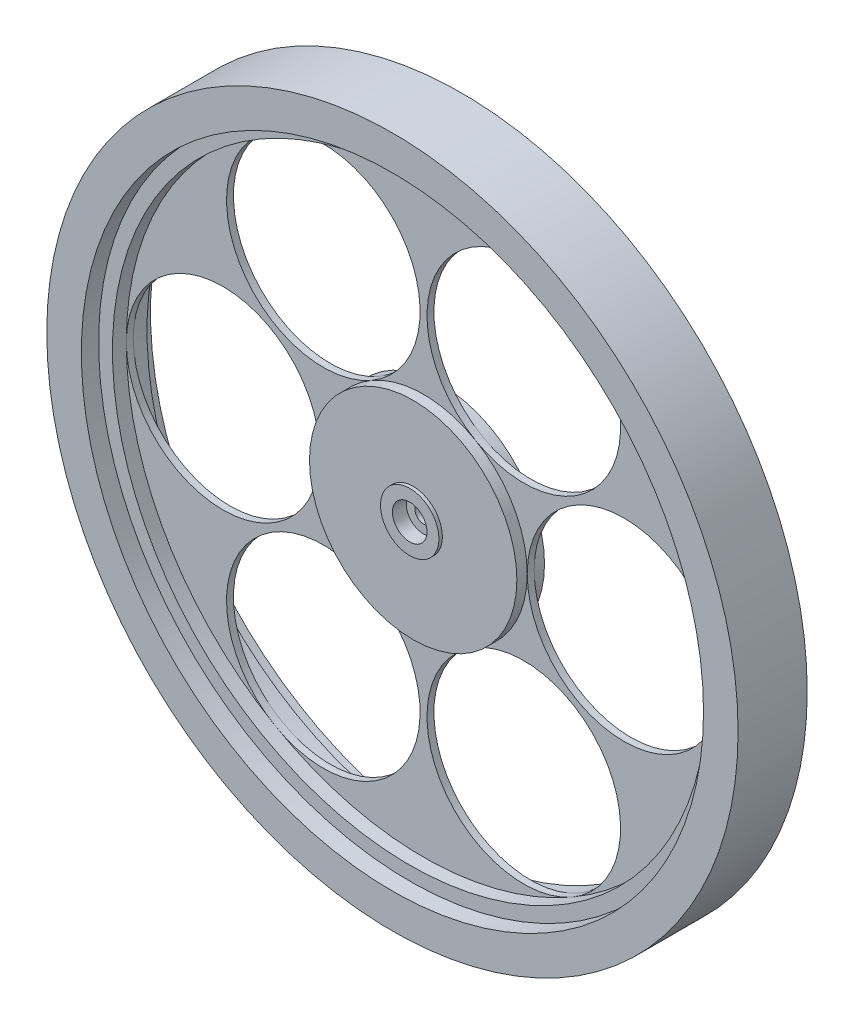
ISO-10303-21;
HEADER;
FILE_DESCRIPTION(('STEP AP214'),'2;1');
FILE_NAME('part.step','',(''),(''),'','','');
FILE_SCHEMA(('AUTOMOTIVE_DESIGN { 1 0 10303 214 1 1 1 1 }'));
ENDSEC;
DATA;
#1=APPLICATION_CONTEXT('core data for automotive mechanical design processes');
#2=APPLICATION_PROTOCOL_DEFINITION('international standard','automotive_design',2000,#1);
#3=PRODUCT_CONTEXT('',#1,'mechanical');
#4=PRODUCT('Part','Part','',(#3));
#5=PRODUCT_RELATED_PRODUCT_CATEGORY('part','',(#4));
#6=PRODUCT_DEFINITION_FORMATION('','',#4);
#7=PRODUCT_DEFINITION_CONTEXT('part definition',#1,'design');
#8=PRODUCT_DEFINITION('design','',#6,#7);
#9=PRODUCT_DEFINITION_SHAPE('','',#8);
#10=(LENGTH_UNIT() NAMED_UNIT(*) SI_UNIT(.MILLI.,.METRE.));
#11=(NAMED_UNIT(*) PLANE_ANGLE_UNIT() SI_UNIT($,.RADIAN.));
#12=(NAMED_UNIT(*) SI_UNIT($,.STERADIAN.) SOLID_ANGLE_UNIT());
#13=UNCERTAINTY_MEASURE_WITH_UNIT(LENGTH_MEASURE(1.E-05),#10,'distance_accuracy_value','');
#14=(GEOMETRIC_REPRESENTATION_CONTEXT(3) GLOBAL_UNCERTAINTY_ASSIGNED_CONTEXT((#13)) GLOBAL_UNIT_ASSIGNED_CONTEXT((#10,
#11,#12)) REPRESENTATION_CONTEXT('',''));
#15=CARTESIAN_POINT('',(0.,0.,0.));
#16=DIRECTION('',(0.,0.,1.));
#17=DIRECTION('',(1.,0.,0.));
#18=AXIS2_PLACEMENT_3D('',#15,#16,#17);
#19=CARTESIAN_POINT('',(0.,0.,2.54));
#20=DIRECTION('',(0.,0.,-1.));
#21=DIRECTION('',(-1.,0.,0.));
#22=AXIS2_PLACEMENT_3D('',#19,#20,#21);
#23=CYLINDRICAL_SURFACE('',#22,19.0500000000001);
#24=CARTESIAN_POINT('',(0.,0.,-2.54));
#25=DIRECTION('',(0.,0.,1.));
#26=DIRECTION('',(1.,0.,0.));
#27=AXIS2_PLACEMENT_3D('',#24,#25,#26);
#28=CIRCLE('',#27,19.0500000000001);
#29=CARTESIAN_POINT('',(19.0500000000001,0.,-2.54));
#30=VERTEX_POINT('',#29);
#31=EDGE_CURVE('E284',#30,#30,#28,.T.);
#32=ORIENTED_EDGE('',*,*,#31,.T.);
#33=EDGE_LOOP('',(#32));
#34=FACE_BOUND('',#33,.T.);
#35=CARTESIAN_POINT('',(0.,0.,-0.635));
#36=DIRECTION('',(0.,0.,1.));
#37=DIRECTION('',(1.,0.,0.));
#38=AXIS2_PLACEMENT_3D('',#35,#36,#37);
#39=CIRCLE('',#38,19.0500000000001);
#40=CARTESIAN_POINT('',(9.52500000000008,16.4977839420936,-0.635));
#41=VERTEX_POINT('',#40);
#42=CARTESIAN_POINT('',(-9.52500000000011,16.4977839420936,-0.635));
#43=VERTEX_POINT('',#42);
#44=EDGE_CURVE('E370',#41,#43,#39,.T.);
#45=ORIENTED_EDGE('',*,*,#44,.F.);
#46=CARTESIAN_POINT('',(0.,0.,-0.635));
#47=DIRECTION('',(0.,0.,1.));
#48=DIRECTION('',(1.,0.,0.));
#49=AXIS2_PLACEMENT_3D('',#46,#47,#48);
#50=CIRCLE('',#49,19.0500000000001);
#51=CARTESIAN_POINT('',(19.0500000000001,0.,-0.635));
#52=VERTEX_POINT('',#51);
#53=EDGE_CURVE('E265',#52,#41,#50,.T.);
#54=ORIENTED_EDGE('',*,*,#53,.F.);
#55=CARTESIAN_POINT('',(0.,0.,-0.635));
#56=DIRECTION('',(0.,0.,1.));
#57=DIRECTION('',(1.,0.,0.));
#58=AXIS2_PLACEMENT_3D('',#55,#56,#57);
#59=CIRCLE('',#58,19.0500000000001);
#60=CARTESIAN_POINT('',(9.52500000000009,-16.4977839420936,-0.635));
#61=VERTEX_POINT('',#60);
#62=EDGE_CURVE('E162',#61,#52,#59,.T.);
#63=ORIENTED_EDGE('',*,*,#62,.F.);
#64=CARTESIAN_POINT('',(0.,0.,-0.635));
#65=DIRECTION('',(0.,0.,1.));
#66=DIRECTION('',(1.,0.,0.));
#67=AXIS2_PLACEMENT_3D('',#64,#65,#66);
#68=CIRCLE('',#67,19.0500000000001);
#69=CARTESIAN_POINT('',(-9.52499999999999,-16.4977839420936,-0.635));
#70=VERTEX_POINT('',#69);
#71=EDGE_CURVE('E286',#70,#61,#68,.T.);
#72=ORIENTED_EDGE('',*,*,#71,.F.);
#73=CARTESIAN_POINT('',(0.,0.,-0.635));
#74=DIRECTION('',(0.,0.,1.));
#75=DIRECTION('',(1.,0.,0.));
#76=AXIS2_PLACEMENT_3D('',#73,#74,#75);
#77=CIRCLE('',#76,19.0500000000001);
#78=CARTESIAN_POINT('',(-19.0500000000001,0.,-0.635));
#79=VERTEX_POINT('',#78);
#80=EDGE_CURVE('E340',#79,#70,#77,.T.);
#81=ORIENTED_EDGE('',*,*,#80,.F.);
#82=CARTESIAN_POINT('',(0.,0.,-0.635));
#83=DIRECTION('',(0.,0.,1.));
#84=DIRECTION('',(1.,0.,0.));
#85=AXIS2_PLACEMENT_3D('',#82,#83,#84);
#86=CIRCLE('',#85,19.0500000000001);
#87=EDGE_CURVE('E312',#43,#79,#86,.T.);
#88=ORIENTED_EDGE('',*,*,#87,.F.);
#89=EDGE_LOOP('',(#45,#54,#63,#72,#81,#88));
#90=FACE_BOUND('',#89,.T.);
#91=ADVANCED_FACE('F137',(#34,#90),#23,.T.);
#92=CARTESIAN_POINT('',(-36.83,0.,0.635));
#93=DIRECTION('',(0.,0.,-1.));
#94=DIRECTION('',(-1.,0.,0.));
#95=AXIS2_PLACEMENT_3D('',#92,#93,#94);
#96=CYLINDRICAL_SURFACE('',#95,17.78);
#97=CARTESIAN_POINT('',(-36.83,0.,-0.635));
#98=DIRECTION('',(0.,0.,1.));
#99=DIRECTION('',(1.,0.,0.));
#100=AXIS2_PLACEMENT_3D('',#97,#98,#99);
#101=CIRCLE('',#100,17.78);
#102=CARTESIAN_POINT('',(-54.61,0.,-0.635));
#103=VERTEX_POINT('',#102);
#104=EDGE_CURVE('E332',#103,#79,#101,.T.);
#105=ORIENTED_EDGE('',*,*,#104,.F.);
#106=CARTESIAN_POINT('',(-36.83,0.,-0.635));
#107=DIRECTION('',(0.,0.,1.));
#108=DIRECTION('',(1.,0.,0.));
#109=AXIS2_PLACEMENT_3D('',#106,#107,#108);
#110=CIRCLE('',#109,17.78);
#111=EDGE_CURVE('E300',#79,#103,#110,.T.);
#112=ORIENTED_EDGE('',*,*,#111,.F.);
#113=EDGE_LOOP('',(#105,#112));
#114=FACE_BOUND('',#113,.T.);
#115=CARTESIAN_POINT('',(-36.83,0.,0.635));
#116=DIRECTION('',(0.,0.,1.));
#117=DIRECTION('',(1.,0.,0.));
#118=AXIS2_PLACEMENT_3D('',#115,#116,#117);
#119=CIRCLE('',#118,17.78);
#120=CARTESIAN_POINT('',(-19.0500000000001,0.,0.635));
#121=VERTEX_POINT('',#120);
#122=CARTESIAN_POINT('',(-54.61,0.,0.635));
#123=VERTEX_POINT('',#122);
#124=EDGE_CURVE('E303',#121,#123,#119,.T.);
#125=ORIENTED_EDGE('',*,*,#124,.T.);
#126=CARTESIAN_POINT('',(-36.83,0.,0.635));
#127=DIRECTION('',(0.,0.,1.));
#128=DIRECTION('',(1.,0.,0.));
#129=AXIS2_PLACEMENT_3D('',#126,#127,#128);
#130=CIRCLE('',#129,17.78);
#131=EDGE_CURVE('E421',#123,#121,#130,.T.);
#132=ORIENTED_EDGE('',*,*,#131,.T.);
#133=EDGE_LOOP('',(#125,#132));
#134=FACE_BOUND('',#133,.T.);
#135=ADVANCED_FACE('F139',(#114,#134),#96,.F.);
#136=CARTESIAN_POINT('',(-18.4150000000002,31.8957156213808,0.635));
#137=DIRECTION('',(0.,0.,-1.));
#138=DIRECTION('',(-1.,0.,0.));
#139=AXIS2_PLACEMENT_3D('',#136,#137,#138);
#140=CYLINDRICAL_SURFACE('',#139,17.78);
#141=CARTESIAN_POINT('',(-18.4150000000002,31.8957156213808,-0.635));
#142=DIRECTION('',(0.,0.,1.));
#143=DIRECTION('',(1.,0.,0.));
#144=AXIS2_PLACEMENT_3D('',#141,#142,#143);
#145=CIRCLE('',#144,17.78);
#146=CARTESIAN_POINT('',(-27.3050000000002,47.2936473006681,-0.635));
#147=VERTEX_POINT('',#146);
#148=EDGE_CURVE('E314',#147,#43,#145,.T.);
#149=ORIENTED_EDGE('',*,*,#148,.F.);
#150=CARTESIAN_POINT('',(-18.4150000000002,31.8957156213808,-0.635));
#151=DIRECTION('',(0.,0.,1.));
#152=DIRECTION('',(1.,0.,0.));
#153=AXIS2_PLACEMENT_3D('',#150,#151,#152);
#154=CIRCLE('',#153,17.78);
#155=EDGE_CURVE('E348',#43,#147,#154,.T.);
#156=ORIENTED_EDGE('',*,*,#155,.F.);
#157=EDGE_LOOP('',(#149,#156));
#158=FACE_BOUND('',#157,.T.);
#159=CARTESIAN_POINT('',(-18.4150000000002,31.8957156213808,0.635));
#160=DIRECTION('',(0.,0.,1.));
#161=DIRECTION('',(1.,0.,0.));
#162=AXIS2_PLACEMENT_3D('',#159,#160,#161);
#163=CIRCLE('',#162,17.78);
#164=CARTESIAN_POINT('',(-9.52500000000011,16.4977839420936,0.635));
#165=VERTEX_POINT('',#164);
#166=CARTESIAN_POINT('',(-27.3050000000002,47.2936473006681,0.635));
#167=VERTEX_POINT('',#166);
#168=EDGE_CURVE('E356',#165,#167,#163,.T.);
#169=ORIENTED_EDGE('',*,*,#168,.T.);
#170=CARTESIAN_POINT('',(-18.4150000000002,31.8957156213808,0.635));
#171=DIRECTION('',(0.,0.,1.));
#172=DIRECTION('',(1.,0.,0.));
#173=AXIS2_PLACEMENT_3D('',#170,#171,#172);
#174=CIRCLE('',#173,17.78);
#175=EDGE_CURVE('E146',#167,#165,#174,.T.);
#176=ORIENTED_EDGE('',*,*,#175,.T.);
#177=EDGE_LOOP('',(#169,#176));
#178=FACE_BOUND('',#177,.T.);
#179=ADVANCED_FACE('F484',(#158,#178),#140,.F.);
#180=CARTESIAN_POINT('',(0.,0.,0.635));
#181=DIRECTION('',(0.,0.,1.));
#182=DIRECTION('',(1.,0.,0.));
#183=AXIS2_PLACEMENT_3D('',#180,#181,#182);
#184=PLANE('',#183);
#185=ORIENTED_EDGE('',*,*,#124,.F.);
#186=CARTESIAN_POINT('',(0.,0.,0.635));
#187=DIRECTION('',(0.,0.,1.));
#188=DIRECTION('',(1.,0.,0.));
#189=AXIS2_PLACEMENT_3D('',#186,#187,#188);
#190=CIRCLE('',#189,19.0500000000001);
#191=EDGE_CURVE('E306',#165,#121,#190,.T.);
#192=ORIENTED_EDGE('',*,*,#191,.F.);
#193=ORIENTED_EDGE('',*,*,#175,.F.);
#194=CARTESIAN_POINT('',(0.,0.,0.635));
#195=DIRECTION('',(0.,0.,1.));
#196=DIRECTION('',(1.,0.,0.));
#197=AXIS2_PLACEMENT_3D('',#194,#195,#196);
#198=CIRCLE('',#197,54.61);
#199=EDGE_CURVE('E12',#167,#123,#198,.T.);
#200=ORIENTED_EDGE('',*,*,#199,.T.);
#201=EDGE_LOOP('',(#185,#192,#193,#200));
#202=FACE_BOUND('',#201,.T.);
#203=ADVANCED_FACE('F417',(#202),#184,.T.);
#204=CARTESIAN_POINT('',(0.,0.,-0.635));
#205=DIRECTION('',(0.,0.,1.));
#206=DIRECTION('',(1.,0.,0.));
#207=AXIS2_PLACEMENT_3D('',#204,#205,#206);
#208=PLANE('',#207);
#209=ORIENTED_EDGE('',*,*,#111,.T.);
#210=CARTESIAN_POINT('',(0.,0.,-0.635));
#211=DIRECTION('',(0.,0.,1.));
#212=DIRECTION('',(1.,0.,0.));
#213=AXIS2_PLACEMENT_3D('',#210,#211,#212);
#214=CIRCLE('',#213,54.61);
#215=EDGE_CURVE('E141',#147,#103,#214,.T.);
#216=ORIENTED_EDGE('',*,*,#215,.F.);
#217=ORIENTED_EDGE('',*,*,#148,.T.);
#218=ORIENTED_EDGE('',*,*,#87,.T.);
#219=EDGE_LOOP('',(#209,#216,#217,#218));
#220=FACE_BOUND('',#219,.T.);
#221=ADVANCED_FACE('F490',(#220),#208,.F.);
#222=CARTESIAN_POINT('',(0.,0.,0.635));
#223=DIRECTION('',(0.,0.,1.));
#224=DIRECTION('',(1.,0.,0.));
#225=AXIS2_PLACEMENT_3D('',#222,#223,#224);
#226=CIRCLE('',#225,19.0500000000001);
#227=CARTESIAN_POINT('',(19.0500000000001,0.,0.635));
#228=VERTEX_POINT('',#227);
#229=CARTESIAN_POINT('',(9.52500000000013,16.4977839420937,0.635));
#230=VERTEX_POINT('',#229);
#231=EDGE_CURVE('E154',#228,#230,#226,.T.);
#232=ORIENTED_EDGE('',*,*,#231,.T.);
#233=CARTESIAN_POINT('',(0.,0.,0.635));
#234=DIRECTION('',(0.,0.,1.));
#235=DIRECTION('',(1.,0.,0.));
#236=AXIS2_PLACEMENT_3D('',#233,#234,#235);
#237=CIRCLE('',#236,19.0500000000001);
#238=EDGE_CURVE('E359',#230,#165,#237,.T.);
#239=ORIENTED_EDGE('',*,*,#238,.T.);
#240=ORIENTED_EDGE('',*,*,#191,.T.);
#241=CARTESIAN_POINT('',(0.,0.,0.635));
#242=DIRECTION('',(0.,0.,1.));
#243=DIRECTION('',(1.,0.,0.));
#244=AXIS2_PLACEMENT_3D('',#241,#242,#243);
#245=CIRCLE('',#244,19.0500000000001);
#246=CARTESIAN_POINT('',(-9.52499999999999,-16.4977839420936,0.635));
#247=VERTEX_POINT('',#246);
#248=EDGE_CURVE('E425',#121,#247,#245,.T.);
#249=ORIENTED_EDGE('',*,*,#248,.T.);
#250=CARTESIAN_POINT('',(0.,0.,0.635));
#251=DIRECTION('',(0.,0.,1.));
#252=DIRECTION('',(1.,0.,0.));
#253=AXIS2_PLACEMENT_3D('',#250,#251,#252);
#254=CIRCLE('',#253,19.0500000000001);
#255=CARTESIAN_POINT('',(9.52500000000009,-16.4977839420936,0.635));
#256=VERTEX_POINT('',#255);
#257=EDGE_CURVE('E244',#247,#256,#254,.T.);
#258=ORIENTED_EDGE('',*,*,#257,.T.);
#259=CARTESIAN_POINT('',(0.,0.,0.635));
#260=DIRECTION('',(0.,0.,1.));
#261=DIRECTION('',(1.,0.,0.));
#262=AXIS2_PLACEMENT_3D('',#259,#260,#261);
#263=CIRCLE('',#262,19.0500000000001);
#264=EDGE_CURVE('E233',#256,#228,#263,.T.);
#265=ORIENTED_EDGE('',*,*,#264,.T.);
#266=EDGE_LOOP('',(#232,#239,#240,#249,#258,#265));
#267=FACE_BOUND('',#266,.T.);
#268=CARTESIAN_POINT('',(0.,0.,2.54));
#269=DIRECTION('',(0.,0.,1.));
#270=DIRECTION('',(1.,0.,0.));
#271=AXIS2_PLACEMENT_3D('',#268,#269,#270);
#272=CIRCLE('',#271,19.0500000000001);
#273=CARTESIAN_POINT('',(19.0500000000001,0.,2.54));
#274=VERTEX_POINT('',#273);
#275=EDGE_CURVE('E297',#274,#274,#272,.T.);
#276=ORIENTED_EDGE('',*,*,#275,.F.);
#277=EDGE_LOOP('',(#276));
#278=FACE_BOUND('',#277,.T.);
#279=ADVANCED_FACE('F240',(#267,#278),#23,.T.);
#280=CARTESIAN_POINT('',(0.,0.,2.54));
#281=DIRECTION('',(0.,0.,1.));
#282=DIRECTION('',(1.,0.,0.));
#283=AXIS2_PLACEMENT_3D('',#280,#281,#282);
#284=PLANE('',#283);
#285=CARTESIAN_POINT('',(0.,0.,2.54));
#286=DIRECTION('',(0.,0.,1.));
#287=DIRECTION('',(1.,0.,0.));
#288=AXIS2_PLACEMENT_3D('',#285,#286,#287);
#289=CIRCLE('',#288,5.36395316401893);
#290=CARTESIAN_POINT('',(5.36395316401893,0.,2.54));
#291=VERTEX_POINT('',#290);
#292=EDGE_CURVE('E294',#291,#291,#289,.T.);
#293=ORIENTED_EDGE('',*,*,#292,.F.);
#294=EDGE_LOOP('',(#293));
#295=FACE_BOUND('',#294,.T.);
#296=ORIENTED_EDGE('',*,*,#275,.T.);
#297=EDGE_LOOP('',(#296));
#298=FACE_BOUND('',#297,.T.);
#299=ADVANCED_FACE('F489',(#295,#298),#284,.T.);
#300=CARTESIAN_POINT('',(0.,0.,-2.54));
#301=DIRECTION('',(0.,0.,1.));
#302=DIRECTION('',(1.,0.,0.));
#303=AXIS2_PLACEMENT_3D('',#300,#301,#302);
#304=PLANE('',#303);
#305=CARTESIAN_POINT('',(0.,0.,-2.54));
#306=DIRECTION('',(0.,0.,1.));
#307=DIRECTION('',(1.,0.,0.));
#308=AXIS2_PLACEMENT_3D('',#305,#306,#307);
#309=CIRCLE('',#308,5.36395316401893);
#310=CARTESIAN_POINT('',(5.36395316401893,0.,-2.54));
#311=VERTEX_POINT('',#310);
#312=EDGE_CURVE('E266',#311,#311,#309,.F.);
#313=ORIENTED_EDGE('',*,*,#312,.F.);
#314=EDGE_LOOP('',(#313));
#315=FACE_BOUND('',#314,.T.);
#316=ORIENTED_EDGE('',*,*,#31,.F.);
#317=EDGE_LOOP('',(#316));
#318=FACE_BOUND('',#317,.T.);
#319=ADVANCED_FACE('F495',(#315,#318),#304,.F.);
#320=CARTESIAN_POINT('',(18.4150000000001,-31.8957156213808,0.635));
#321=DIRECTION('',(0.,0.,-1.));
#322=DIRECTION('',(-1.,0.,0.));
#323=AXIS2_PLACEMENT_3D('',#320,#321,#322);
#324=CYLINDRICAL_SURFACE('',#323,17.78);
#325=CARTESIAN_POINT('',(18.4150000000001,-31.8957156213808,-0.635));
#326=DIRECTION('',(0.,0.,1.));
#327=DIRECTION('',(1.,0.,0.));
#328=AXIS2_PLACEMENT_3D('',#325,#326,#327);
#329=CIRCLE('',#328,17.78);
#330=CARTESIAN_POINT('',(27.3050000000002,-47.2936473006681,-0.635));
#331=VERTEX_POINT('',#330);
#332=EDGE_CURVE('E259',#61,#331,#329,.T.);
#333=ORIENTED_EDGE('',*,*,#332,.F.);
#334=CARTESIAN_POINT('',(18.4150000000001,-31.8957156213808,-0.635));
#335=DIRECTION('',(0.,0.,1.));
#336=DIRECTION('',(1.,0.,0.));
#337=AXIS2_PLACEMENT_3D('',#334,#335,#336);
#338=CIRCLE('',#337,17.78);
#339=EDGE_CURVE('E438',#331,#61,#338,.T.);
#340=ORIENTED_EDGE('',*,*,#339,.F.);
#341=EDGE_LOOP('',(#333,#340));
#342=FACE_BOUND('',#341,.T.);
#343=CARTESIAN_POINT('',(18.4150000000001,-31.8957156213808,0.635));
#344=DIRECTION('',(0.,0.,1.));
#345=DIRECTION('',(1.,0.,0.));
#346=AXIS2_PLACEMENT_3D('',#343,#344,#345);
#347=CIRCLE('',#346,17.78);
#348=CARTESIAN_POINT('',(27.3050000000002,-47.2936473006681,0.635));
#349=VERTEX_POINT('',#348);
#350=EDGE_CURVE('E432',#349,#256,#347,.T.);
#351=ORIENTED_EDGE('',*,*,#350,.T.);
#352=CARTESIAN_POINT('',(18.4150000000001,-31.8957156213808,0.635));
#353=DIRECTION('',(0.,0.,1.));
#354=DIRECTION('',(1.,0.,0.));
#355=AXIS2_PLACEMENT_3D('',#352,#353,#354);
#356=CIRCLE('',#355,17.78);
#357=EDGE_CURVE('E274',#256,#349,#356,.T.);
#358=ORIENTED_EDGE('',*,*,#357,.T.);
#359=EDGE_LOOP('',(#351,#358));
#360=FACE_BOUND('',#359,.T.);
#361=ADVANCED_FACE('F524',(#342,#360),#324,.F.);
#362=CARTESIAN_POINT('',(-18.4149999999999,-31.8957156213809,0.635));
#363=DIRECTION('',(0.,0.,-1.));
#364=DIRECTION('',(-1.,0.,0.));
#365=AXIS2_PLACEMENT_3D('',#362,#363,#364);
#366=CYLINDRICAL_SURFACE('',#365,17.78);
#367=CARTESIAN_POINT('',(-18.4149999999999,-31.8957156213809,-0.635));
#368=DIRECTION('',(0.,0.,1.));
#369=DIRECTION('',(1.,0.,0.));
#370=AXIS2_PLACEMENT_3D('',#367,#368,#369);
#371=CIRCLE('',#370,17.78);
#372=CARTESIAN_POINT('',(-27.3049999999999,-47.2936473006683,-0.635));
#373=VERTEX_POINT('',#372);
#374=EDGE_CURVE('E246',#70,#373,#371,.T.);
#375=ORIENTED_EDGE('',*,*,#374,.F.);
#376=CARTESIAN_POINT('',(-18.4149999999999,-31.8957156213809,-0.635));
#377=DIRECTION('',(0.,0.,1.));
#378=DIRECTION('',(1.,0.,0.));
#379=AXIS2_PLACEMENT_3D('',#376,#377,#378);
#380=CIRCLE('',#379,17.78);
#381=EDGE_CURVE('E289',#373,#70,#380,.T.);
#382=ORIENTED_EDGE('',*,*,#381,.F.);
#383=EDGE_LOOP('',(#375,#382));
#384=FACE_BOUND('',#383,.T.);
#385=CARTESIAN_POINT('',(-18.4149999999999,-31.8957156213809,0.635));
#386=DIRECTION('',(0.,0.,1.));
#387=DIRECTION('',(1.,0.,0.));
#388=AXIS2_PLACEMENT_3D('',#385,#386,#387);
#389=CIRCLE('',#388,17.78);
#390=CARTESIAN_POINT('',(-27.3049999999999,-47.2936473006683,0.635));
#391=VERTEX_POINT('',#390);
#392=EDGE_CURVE('E279',#391,#247,#389,.T.);
#393=ORIENTED_EDGE('',*,*,#392,.T.);
#394=CARTESIAN_POINT('',(-18.4149999999999,-31.8957156213809,0.635));
#395=DIRECTION('',(0.,0.,1.));
#396=DIRECTION('',(1.,0.,0.));
#397=AXIS2_PLACEMENT_3D('',#394,#395,#396);
#398=CIRCLE('',#397,17.78);
#399=EDGE_CURVE('E335',#247,#391,#398,.T.);
#400=ORIENTED_EDGE('',*,*,#399,.T.);
#401=EDGE_LOOP('',(#393,#400));
#402=FACE_BOUND('',#401,.T.);
#403=ADVANCED_FACE('F515',(#384,#402),#366,.F.);
#404=CARTESIAN_POINT('',(0.,0.,0.635));
#405=DIRECTION('',(0.,0.,1.));
#406=DIRECTION('',(1.,0.,0.));
#407=AXIS2_PLACEMENT_3D('',#404,#405,#406);
#408=PLANE('',#407);
#409=ORIENTED_EDGE('',*,*,#357,.F.);
#410=ORIENTED_EDGE('',*,*,#257,.F.);
#411=ORIENTED_EDGE('',*,*,#392,.F.);
#412=CARTESIAN_POINT('',(0.,0.,0.635));
#413=DIRECTION('',(0.,0.,1.));
#414=DIRECTION('',(1.,0.,0.));
#415=AXIS2_PLACEMENT_3D('',#412,#413,#414);
#416=CIRCLE('',#415,54.61);
#417=EDGE_CURVE('E282',#391,#349,#416,.T.);
#418=ORIENTED_EDGE('',*,*,#417,.T.);
#419=EDGE_LOOP('',(#409,#410,#411,#418));
#420=FACE_BOUND('',#419,.T.);
#421=ADVANCED_FACE('F529',(#420),#408,.T.);
#422=CARTESIAN_POINT('',(0.,0.,-0.635));
#423=DIRECTION('',(0.,0.,1.));
#424=DIRECTION('',(1.,0.,0.));
#425=AXIS2_PLACEMENT_3D('',#422,#423,#424);
#426=PLANE('',#425);
#427=ORIENTED_EDGE('',*,*,#332,.T.);
#428=CARTESIAN_POINT('',(0.,0.,-0.635));
#429=DIRECTION('',(0.,0.,1.));
#430=DIRECTION('',(1.,0.,0.));
#431=AXIS2_PLACEMENT_3D('',#428,#429,#430);
#432=CIRCLE('',#431,54.61);
#433=EDGE_CURVE('E277',#373,#331,#432,.T.);
#434=ORIENTED_EDGE('',*,*,#433,.F.);
#435=ORIENTED_EDGE('',*,*,#381,.T.);
#436=ORIENTED_EDGE('',*,*,#71,.T.);
#437=EDGE_LOOP('',(#427,#434,#435,#436));
#438=FACE_BOUND('',#437,.T.);
#439=ADVANCED_FACE('F518',(#438),#426,.F.);
#440=CARTESIAN_POINT('',(18.4150000000001,31.8957156213809,0.635));
#441=DIRECTION('',(0.,0.,-1.));
#442=DIRECTION('',(-1.,0.,0.));
#443=AXIS2_PLACEMENT_3D('',#440,#441,#442);
#444=CYLINDRICAL_SURFACE('',#443,17.7799999999998);
#445=CARTESIAN_POINT('',(18.4150000000001,31.8957156213809,-0.635));
#446=DIRECTION('',(0.,0.,1.));
#447=DIRECTION('',(1.,0.,0.));
#448=AXIS2_PLACEMENT_3D('',#445,#446,#447);
#449=CIRCLE('',#448,17.7799999999998);
#450=CARTESIAN_POINT('',(27.3050000000001,47.2936473006681,-0.635));
#451=VERTEX_POINT('',#450);
#452=EDGE_CURVE('E263',#41,#451,#449,.T.);
#453=ORIENTED_EDGE('',*,*,#452,.F.);
#454=CARTESIAN_POINT('',(18.4150000000001,31.8957156213809,-0.635));
#455=DIRECTION('',(0.,0.,1.));
#456=DIRECTION('',(1.,0.,0.));
#457=AXIS2_PLACEMENT_3D('',#454,#455,#456);
#458=CIRCLE('',#457,17.7799999999998);
#459=EDGE_CURVE('E373',#451,#41,#458,.T.);
#460=ORIENTED_EDGE('',*,*,#459,.F.);
#461=EDGE_LOOP('',(#453,#460));
#462=FACE_BOUND('',#461,.T.);
#463=CARTESIAN_POINT('',(18.4150000000001,31.8957156213809,0.635));
#464=DIRECTION('',(0.,0.,1.));
#465=DIRECTION('',(1.,0.,0.));
#466=AXIS2_PLACEMENT_3D('',#463,#464,#465);
#467=CIRCLE('',#466,17.7799999999998);
#468=CARTESIAN_POINT('',(27.3050000000001,47.2936473006681,0.635));
#469=VERTEX_POINT('',#468);
#470=EDGE_CURVE('E361',#469,#230,#467,.T.);
#471=ORIENTED_EDGE('',*,*,#470,.T.);
#472=CARTESIAN_POINT('',(18.4150000000001,31.8957156213809,0.635));
#473=DIRECTION('',(0.,0.,1.));
#474=DIRECTION('',(1.,0.,0.));
#475=AXIS2_PLACEMENT_3D('',#472,#473,#474);
#476=CIRCLE('',#475,17.7799999999998);
#477=EDGE_CURVE('E253',#230,#469,#476,.T.);
#478=ORIENTED_EDGE('',*,*,#477,.T.);
#479=EDGE_LOOP('',(#471,#478));
#480=FACE_BOUND('',#479,.T.);
#481=ADVANCED_FACE('F403',(#462,#480),#444,.F.);
#482=CARTESIAN_POINT('',(36.83,0.,0.635));
#483=DIRECTION('',(0.,0.,-1.));
#484=DIRECTION('',(-1.,0.,0.));
#485=AXIS2_PLACEMENT_3D('',#482,#483,#484);
#486=CYLINDRICAL_SURFACE('',#485,17.78);
#487=CARTESIAN_POINT('',(36.83,0.,-0.635));
#488=DIRECTION('',(0.,0.,1.));
#489=DIRECTION('',(1.,0.,0.));
#490=AXIS2_PLACEMENT_3D('',#487,#488,#489);
#491=CIRCLE('',#490,17.78);
#492=CARTESIAN_POINT('',(54.61,0.,-0.635));
#493=VERTEX_POINT('',#492);
#494=EDGE_CURVE('E433',#52,#493,#491,.T.);
#495=ORIENTED_EDGE('',*,*,#494,.F.);
#496=CARTESIAN_POINT('',(36.83,0.,-0.635));
#497=DIRECTION('',(0.,0.,1.));
#498=DIRECTION('',(1.,0.,0.));
#499=AXIS2_PLACEMENT_3D('',#496,#497,#498);
#500=CIRCLE('',#499,17.78);
#501=EDGE_CURVE('E268',#493,#52,#500,.T.);
#502=ORIENTED_EDGE('',*,*,#501,.F.);
#503=EDGE_LOOP('',(#495,#502));
#504=FACE_BOUND('',#503,.T.);
#505=CARTESIAN_POINT('',(36.83,0.,0.635));
#506=DIRECTION('',(0.,0.,1.));
#507=DIRECTION('',(1.,0.,0.));
#508=AXIS2_PLACEMENT_3D('',#505,#506,#507);
#509=CIRCLE('',#508,17.78);
#510=CARTESIAN_POINT('',(54.61,0.,0.635));
#511=VERTEX_POINT('',#510);
#512=EDGE_CURVE('E250',#511,#228,#509,.T.);
#513=ORIENTED_EDGE('',*,*,#512,.T.);
#514=CARTESIAN_POINT('',(36.83,0.,0.635));
#515=DIRECTION('',(0.,0.,1.));
#516=DIRECTION('',(1.,0.,0.));
#517=AXIS2_PLACEMENT_3D('',#514,#515,#516);
#518=CIRCLE('',#517,17.78);
#519=EDGE_CURVE('E230',#228,#511,#518,.T.);
#520=ORIENTED_EDGE('',*,*,#519,.T.);
#521=EDGE_LOOP('',(#513,#520));
#522=FACE_BOUND('',#521,.T.);
#523=ADVANCED_FACE('F256',(#504,#522),#486,.F.);
#524=CARTESIAN_POINT('',(0.,0.,0.635));
#525=DIRECTION('',(0.,0.,1.));
#526=DIRECTION('',(1.,0.,0.));
#527=AXIS2_PLACEMENT_3D('',#524,#525,#526);
#528=PLANE('',#527);
#529=ORIENTED_EDGE('',*,*,#477,.F.);
#530=ORIENTED_EDGE('',*,*,#231,.F.);
#531=ORIENTED_EDGE('',*,*,#512,.F.);
#532=CARTESIAN_POINT('',(0.,0.,0.635));
#533=DIRECTION('',(0.,0.,1.));
#534=DIRECTION('',(1.,0.,0.));
#535=AXIS2_PLACEMENT_3D('',#532,#533,#534);
#536=CIRCLE('',#535,54.61);
#537=EDGE_CURVE('E257',#511,#469,#536,.T.);
#538=ORIENTED_EDGE('',*,*,#537,.T.);
#539=EDGE_LOOP('',(#529,#530,#531,#538));
#540=FACE_BOUND('',#539,.T.);
#541=ADVANCED_FACE('F249',(#540),#528,.T.);
#542=CARTESIAN_POINT('',(0.,0.,-0.635));
#543=DIRECTION('',(0.,0.,1.));
#544=DIRECTION('',(1.,0.,0.));
#545=AXIS2_PLACEMENT_3D('',#542,#543,#544);
#546=PLANE('',#545);
#547=ORIENTED_EDGE('',*,*,#452,.T.);
#548=CARTESIAN_POINT('',(0.,0.,-0.635));
#549=DIRECTION('',(0.,0.,1.));
#550=DIRECTION('',(1.,0.,0.));
#551=AXIS2_PLACEMENT_3D('',#548,#549,#550);
#552=CIRCLE('',#551,54.61);
#553=EDGE_CURVE('E271',#493,#451,#552,.T.);
#554=ORIENTED_EDGE('',*,*,#553,.F.);
#555=ORIENTED_EDGE('',*,*,#501,.T.);
#556=ORIENTED_EDGE('',*,*,#53,.T.);
#557=EDGE_LOOP('',(#547,#554,#555,#556));
#558=FACE_BOUND('',#557,.T.);
#559=ADVANCED_FACE('F548',(#558),#546,.F.);
#560=CARTESIAN_POINT('',(0.,0.,3.175));
#561=DIRECTION('',(0.,0.,-1.));
#562=DIRECTION('',(-1.,0.,0.));
#563=AXIS2_PLACEMENT_3D('',#560,#561,#562);
#564=CYLINDRICAL_SURFACE('',#563,5.36395316401893);
#565=CARTESIAN_POINT('',(0.,0.,-3.175));
#566=DIRECTION('',(0.,0.,1.));
#567=DIRECTION('',(1.,0.,0.));
#568=AXIS2_PLACEMENT_3D('',#565,#566,#567);
#569=CIRCLE('',#568,5.36395316401893);
#570=CARTESIAN_POINT('',(5.36395316401893,0.,-3.175));
#571=VERTEX_POINT('',#570);
#572=EDGE_CURVE('E381',#571,#571,#569,.T.);
#573=ORIENTED_EDGE('',*,*,#572,.T.);
#574=EDGE_LOOP('',(#573));
#575=FACE_BOUND('',#574,.T.);
#576=ORIENTED_EDGE('',*,*,#312,.T.);
#577=EDGE_LOOP('',(#576));
#578=FACE_BOUND('',#577,.T.);
#579=ADVANCED_FACE('F545',(#575,#578),#564,.T.);
#580=CARTESIAN_POINT('',(0.,0.,0.635));
#581=DIRECTION('',(0.,0.,-1.));
#582=DIRECTION('',(-1.,0.,0.));
#583=AXIS2_PLACEMENT_3D('',#580,#581,#582);
#584=CYLINDRICAL_SURFACE('',#583,1.5875);
#585=CARTESIAN_POINT('',(0.,0.,0.635));
#586=DIRECTION('',(0.,0.,1.));
#587=DIRECTION('',(1.,0.,0.));
#588=AXIS2_PLACEMENT_3D('',#585,#586,#587);
#589=CIRCLE('',#588,1.5875);
#590=CARTESIAN_POINT('',(1.5875,0.,0.635));
#591=VERTEX_POINT('',#590);
#592=EDGE_CURVE('E392',#591,#591,#589,.T.);
#593=ORIENTED_EDGE('',*,*,#592,.T.);
#594=EDGE_LOOP('',(#593));
#595=FACE_BOUND('',#594,.T.);
#596=CARTESIAN_POINT('',(0.,0.,-0.635));
#597=DIRECTION('',(0.,0.,1.));
#598=DIRECTION('',(1.,0.,0.));
#599=AXIS2_PLACEMENT_3D('',#596,#597,#598);
#600=CIRCLE('',#599,1.5875);
#601=CARTESIAN_POINT('',(1.5875,0.,-0.635));
#602=VERTEX_POINT('',#601);
#603=EDGE_CURVE('E391',#602,#602,#600,.T.);
#604=ORIENTED_EDGE('',*,*,#603,.F.);
#605=EDGE_LOOP('',(#604));
#606=FACE_BOUND('',#605,.T.);
#607=ADVANCED_FACE('F547',(#595,#606),#584,.F.);
#608=CARTESIAN_POINT('',(0.,0.,0.635));
#609=DIRECTION('',(0.,0.,1.));
#610=DIRECTION('',(1.,0.,0.));
#611=AXIS2_PLACEMENT_3D('',#608,#609,#610);
#612=PLANE('',#611);
#613=ORIENTED_EDGE('',*,*,#592,.F.);
#614=EDGE_LOOP('',(#613));
#615=FACE_BOUND('',#614,.T.);
#616=CARTESIAN_POINT('',(0.,0.,0.635));
#617=DIRECTION('',(0.,0.,1.));
#618=DIRECTION('',(1.,0.,0.));
#619=AXIS2_PLACEMENT_3D('',#616,#617,#618);
#620=CIRCLE('',#619,3.175);
#621=CARTESIAN_POINT('',(3.175,0.,0.635));
#622=VERTEX_POINT('',#621);
#623=EDGE_CURVE('E384',#622,#622,#620,.F.);
#624=ORIENTED_EDGE('',*,*,#623,.F.);
#625=EDGE_LOOP('',(#624));
#626=FACE_BOUND('',#625,.T.);
#627=ADVANCED_FACE('F556',(#615,#626),#612,.T.);
#628=CARTESIAN_POINT('',(0.,0.,-0.635));
#629=DIRECTION('',(0.,0.,1.));
#630=DIRECTION('',(1.,0.,0.));
#631=AXIS2_PLACEMENT_3D('',#628,#629,#630);
#632=PLANE('',#631);
#633=ORIENTED_EDGE('',*,*,#603,.T.);
#634=EDGE_LOOP('',(#633));
#635=FACE_BOUND('',#634,.T.);
#636=CARTESIAN_POINT('',(0.,0.,-0.635));
#637=DIRECTION('',(0.,0.,1.));
#638=DIRECTION('',(1.,0.,0.));
#639=AXIS2_PLACEMENT_3D('',#636,#637,#638);
#640=CIRCLE('',#639,3.175);
#641=CARTESIAN_POINT('',(3.175,0.,-0.635));
#642=VERTEX_POINT('',#641);
#643=EDGE_CURVE('E395',#642,#642,#640,.T.);
#644=ORIENTED_EDGE('',*,*,#643,.F.);
#645=EDGE_LOOP('',(#644));
#646=FACE_BOUND('',#645,.T.);
#647=ADVANCED_FACE('F585',(#635,#646),#632,.F.);
#648=CARTESIAN_POINT('',(0.,0.,3.175));
#649=DIRECTION('',(0.,0.,-1.));
#650=DIRECTION('',(-1.,0.,0.));
#651=AXIS2_PLACEMENT_3D('',#648,#649,#650);
#652=CYLINDRICAL_SURFACE('',#651,3.175);
#653=CARTESIAN_POINT('',(0.,0.,-3.175));
#654=DIRECTION('',(0.,0.,1.));
#655=DIRECTION('',(1.,0.,0.));
#656=AXIS2_PLACEMENT_3D('',#653,#654,#655);
#657=CIRCLE('',#656,3.175);
#658=CARTESIAN_POINT('',(3.175,0.,-3.175));
#659=VERTEX_POINT('',#658);
#660=EDGE_CURVE('E367',#659,#659,#657,.T.);
#661=ORIENTED_EDGE('',*,*,#660,.F.);
#662=EDGE_LOOP('',(#661));
#663=FACE_BOUND('',#662,.T.);
#664=ORIENTED_EDGE('',*,*,#643,.T.);
#665=EDGE_LOOP('',(#664));
#666=FACE_BOUND('',#665,.T.);
#667=ADVANCED_FACE('F574',(#663,#666),#652,.F.);
#668=ORIENTED_EDGE('',*,*,#623,.T.);
#669=EDGE_LOOP('',(#668));
#670=FACE_BOUND('',#669,.T.);
#671=CARTESIAN_POINT('',(0.,0.,3.175));
#672=DIRECTION('',(0.,0.,1.));
#673=DIRECTION('',(1.,0.,0.));
#674=AXIS2_PLACEMENT_3D('',#671,#672,#673);
#675=CIRCLE('',#674,3.175);
#676=CARTESIAN_POINT('',(3.175,0.,3.175));
#677=VERTEX_POINT('',#676);
#678=EDGE_CURVE('E377',#677,#677,#675,.T.);
#679=ORIENTED_EDGE('',*,*,#678,.T.);
#680=EDGE_LOOP('',(#679));
#681=FACE_BOUND('',#680,.T.);
#682=ADVANCED_FACE('F565',(#670,#681),#652,.F.);
#683=ORIENTED_EDGE('',*,*,#292,.T.);
#684=EDGE_LOOP('',(#683));
#685=FACE_BOUND('',#684,.T.);
#686=CARTESIAN_POINT('',(0.,0.,3.175));
#687=DIRECTION('',(0.,0.,1.));
#688=DIRECTION('',(1.,0.,0.));
#689=AXIS2_PLACEMENT_3D('',#686,#687,#688);
#690=CIRCLE('',#689,5.36395316401893);
#691=CARTESIAN_POINT('',(5.36395316401893,0.,3.175));
#692=VERTEX_POINT('',#691);
#693=EDGE_CURVE('E380',#692,#692,#690,.T.);
#694=ORIENTED_EDGE('',*,*,#693,.F.);
#695=EDGE_LOOP('',(#694));
#696=FACE_BOUND('',#695,.T.);
#697=ADVANCED_FACE('F551',(#685,#696),#564,.T.);
#698=CARTESIAN_POINT('',(0.,0.,3.175));
#699=DIRECTION('',(0.,0.,1.));
#700=DIRECTION('',(1.,0.,0.));
#701=AXIS2_PLACEMENT_3D('',#698,#699,#700);
#702=PLANE('',#701);
#703=ORIENTED_EDGE('',*,*,#678,.F.);
#704=EDGE_LOOP('',(#703));
#705=FACE_BOUND('',#704,.T.);
#706=ORIENTED_EDGE('',*,*,#693,.T.);
#707=EDGE_LOOP('',(#706));
#708=FACE_BOUND('',#707,.T.);
#709=ADVANCED_FACE('F564',(#705,#708),#702,.T.);
#710=CARTESIAN_POINT('',(0.,0.,-3.175));
#711=DIRECTION('',(0.,0.,1.));
#712=DIRECTION('',(1.,0.,0.));
#713=AXIS2_PLACEMENT_3D('',#710,#711,#712);
#714=PLANE('',#713);
#715=ORIENTED_EDGE('',*,*,#660,.T.);
#716=EDGE_LOOP('',(#715));
#717=FACE_BOUND('',#716,.T.);
#718=ORIENTED_EDGE('',*,*,#572,.F.);
#719=EDGE_LOOP('',(#718));
#720=FACE_BOUND('',#719,.T.);
#721=ADVANCED_FACE('F571',(#717,#720),#714,.F.);
#722=CARTESIAN_POINT('',(0.,0.,3.175));
#723=DIRECTION('',(0.,0.,-1.));
#724=DIRECTION('',(-1.,0.,0.));
#725=AXIS2_PLACEMENT_3D('',#722,#723,#724);
#726=CYLINDRICAL_SURFACE('',#725,54.61);
#727=CARTESIAN_POINT('',(0.,0.,-3.175));
#728=DIRECTION('',(0.,0.,1.));
#729=DIRECTION('',(1.,0.,0.));
#730=AXIS2_PLACEMENT_3D('',#727,#728,#729);
#731=CIRCLE('',#730,54.61);
#732=CARTESIAN_POINT('',(54.61,0.,-3.175));
#733=VERTEX_POINT('',#732);
#734=EDGE_CURVE('E350',#733,#733,#731,.T.);
#735=ORIENTED_EDGE('',*,*,#734,.F.);
#736=EDGE_LOOP('',(#735));
#737=FACE_BOUND('',#736,.T.);
#738=ORIENTED_EDGE('',*,*,#215,.T.);
#739=CARTESIAN_POINT('',(0.,0.,-0.635));
#740=DIRECTION('',(0.,0.,1.));
#741=DIRECTION('',(1.,0.,0.));
#742=AXIS2_PLACEMENT_3D('',#739,#740,#741);
#743=CIRCLE('',#742,54.61);
#744=EDGE_CURVE('E325',#103,#373,#743,.T.);
#745=ORIENTED_EDGE('',*,*,#744,.T.);
#746=ORIENTED_EDGE('',*,*,#433,.T.);
#747=CARTESIAN_POINT('',(0.,0.,-0.635));
#748=DIRECTION('',(0.,0.,1.));
#749=DIRECTION('',(1.,0.,0.));
#750=AXIS2_PLACEMENT_3D('',#747,#748,#749);
#751=CIRCLE('',#750,54.61);
#752=EDGE_CURVE('E435',#331,#493,#751,.T.);
#753=ORIENTED_EDGE('',*,*,#752,.T.);
#754=ORIENTED_EDGE('',*,*,#553,.T.);
#755=CARTESIAN_POINT('',(0.,0.,-0.635));
#756=DIRECTION('',(0.,0.,1.));
#757=DIRECTION('',(1.,0.,0.));
#758=AXIS2_PLACEMENT_3D('',#755,#756,#757);
#759=CIRCLE('',#758,54.61);
#760=EDGE_CURVE('E327',#451,#147,#759,.T.);
#761=ORIENTED_EDGE('',*,*,#760,.T.);
#762=EDGE_LOOP('',(#738,#745,#746,#753,#754,#761));
#763=FACE_BOUND('',#762,.T.);
#764=ADVANCED_FACE('F324',(#737,#763),#726,.F.);
#765=CARTESIAN_POINT('',(0.,0.,0.635));
#766=DIRECTION('',(0.,0.,1.));
#767=DIRECTION('',(1.,0.,0.));
#768=AXIS2_PLACEMENT_3D('',#765,#766,#767);
#769=PLANE('',#768);
#770=ORIENTED_EDGE('',*,*,#168,.F.);
#771=ORIENTED_EDGE('',*,*,#238,.F.);
#772=ORIENTED_EDGE('',*,*,#470,.F.);
#773=CARTESIAN_POINT('',(0.,0.,0.635));
#774=DIRECTION('',(0.,0.,1.));
#775=DIRECTION('',(1.,0.,0.));
#776=AXIS2_PLACEMENT_3D('',#773,#774,#775);
#777=CIRCLE('',#776,54.61);
#778=EDGE_CURVE('E364',#469,#167,#777,.T.);
#779=ORIENTED_EDGE('',*,*,#778,.T.);
#780=EDGE_LOOP('',(#770,#771,#772,#779));
#781=FACE_BOUND('',#780,.T.);
#782=ADVANCED_FACE('F407',(#781),#769,.T.);
#783=CARTESIAN_POINT('',(0.,0.,-0.635));
#784=DIRECTION('',(0.,0.,1.));
#785=DIRECTION('',(1.,0.,0.));
#786=AXIS2_PLACEMENT_3D('',#783,#784,#785);
#787=PLANE('',#786);
#788=ORIENTED_EDGE('',*,*,#155,.T.);
#789=ORIENTED_EDGE('',*,*,#760,.F.);
#790=ORIENTED_EDGE('',*,*,#459,.T.);
#791=ORIENTED_EDGE('',*,*,#44,.T.);
#792=EDGE_LOOP('',(#788,#789,#790,#791));
#793=FACE_BOUND('',#792,.T.);
#794=ADVANCED_FACE('F508',(#793),#787,.F.);
#795=CARTESIAN_POINT('',(0.,0.,0.635));
#796=DIRECTION('',(0.,0.,1.));
#797=DIRECTION('',(1.,0.,0.));
#798=AXIS2_PLACEMENT_3D('',#795,#796,#797);
#799=CIRCLE('',#798,54.61);
#800=EDGE_CURVE('E353',#123,#391,#799,.T.);
#801=ORIENTED_EDGE('',*,*,#800,.F.);
#802=ORIENTED_EDGE('',*,*,#199,.F.);
#803=ORIENTED_EDGE('',*,*,#778,.F.);
#804=ORIENTED_EDGE('',*,*,#537,.F.);
#805=CARTESIAN_POINT('',(0.,0.,0.635));
#806=DIRECTION('',(0.,0.,1.));
#807=DIRECTION('',(1.,0.,0.));
#808=AXIS2_PLACEMENT_3D('',#805,#806,#807);
#809=CIRCLE('',#808,54.61);
#810=EDGE_CURVE('E236',#349,#511,#809,.T.);
#811=ORIENTED_EDGE('',*,*,#810,.F.);
#812=ORIENTED_EDGE('',*,*,#417,.F.);
#813=EDGE_LOOP('',(#801,#802,#803,#804,#811,#812));
#814=FACE_BOUND('',#813,.T.);
#815=CARTESIAN_POINT('',(0.,0.,3.175));
#816=DIRECTION('',(0.,0.,1.));
#817=DIRECTION('',(1.,0.,0.));
#818=AXIS2_PLACEMENT_3D('',#815,#816,#817);
#819=CIRCLE('',#818,54.61);
#820=CARTESIAN_POINT('',(54.61,0.,3.175));
#821=VERTEX_POINT('',#820);
#822=EDGE_CURVE('E345',#821,#821,#819,.T.);
#823=ORIENTED_EDGE('',*,*,#822,.T.);
#824=EDGE_LOOP('',(#823));
#825=FACE_BOUND('',#824,.T.);
#826=ADVANCED_FACE('F411',(#814,#825),#726,.F.);
#827=CARTESIAN_POINT('',(0.,0.,3.175));
#828=DIRECTION('',(0.,0.,1.));
#829=DIRECTION('',(1.,0.,0.));
#830=AXIS2_PLACEMENT_3D('',#827,#828,#829);
#831=PLANE('',#830);
#832=ORIENTED_EDGE('',*,*,#822,.F.);
#833=EDGE_LOOP('',(#832));
#834=FACE_BOUND('',#833,.T.);
#835=CARTESIAN_POINT('',(0.,0.,3.175));
#836=DIRECTION('',(0.,0.,1.));
#837=DIRECTION('',(1.,0.,0.));
#838=AXIS2_PLACEMENT_3D('',#835,#836,#837);
#839=CIRCLE('',#838,57.15);
#840=CARTESIAN_POINT('',(57.15,0.,3.175));
#841=VERTEX_POINT('',#840);
#842=EDGE_CURVE('E439',#841,#841,#839,.F.);
#843=ORIENTED_EDGE('',*,*,#842,.F.);
#844=EDGE_LOOP('',(#843));
#845=FACE_BOUND('',#844,.T.);
#846=ADVANCED_FACE('F741',(#834,#845),#831,.T.);
#847=CARTESIAN_POINT('',(0.,0.,-3.175));
#848=DIRECTION('',(0.,0.,1.));
#849=DIRECTION('',(1.,0.,0.));
#850=AXIS2_PLACEMENT_3D('',#847,#848,#849);
#851=PLANE('',#850);
#852=ORIENTED_EDGE('',*,*,#734,.T.);
#853=EDGE_LOOP('',(#852));
#854=FACE_BOUND('',#853,.T.);
#855=CARTESIAN_POINT('',(0.,0.,-3.175));
#856=DIRECTION('',(0.,0.,1.));
#857=DIRECTION('',(1.,0.,0.));
#858=AXIS2_PLACEMENT_3D('',#855,#856,#857);
#859=CIRCLE('',#858,57.15);
#860=CARTESIAN_POINT('',(57.15,0.,-3.175));
#861=VERTEX_POINT('',#860);
#862=EDGE_CURVE('E349',#861,#861,#859,.T.);
#863=ORIENTED_EDGE('',*,*,#862,.F.);
#864=EDGE_LOOP('',(#863));
#865=FACE_BOUND('',#864,.T.);
#866=ADVANCED_FACE('F734',(#854,#865),#851,.F.);
#867=CARTESIAN_POINT('',(0.,0.,0.635));
#868=DIRECTION('',(0.,0.,1.));
#869=DIRECTION('',(1.,0.,0.));
#870=AXIS2_PLACEMENT_3D('',#867,#868,#869);
#871=PLANE('',#870);
#872=ORIENTED_EDGE('',*,*,#399,.F.);
#873=ORIENTED_EDGE('',*,*,#248,.F.);
#874=ORIENTED_EDGE('',*,*,#131,.F.);
#875=ORIENTED_EDGE('',*,*,#800,.T.);
#876=EDGE_LOOP('',(#872,#873,#874,#875));
#877=FACE_BOUND('',#876,.T.);
#878=ADVANCED_FACE('F423',(#877),#871,.T.);
#879=CARTESIAN_POINT('',(0.,0.,-0.635));
#880=DIRECTION('',(0.,0.,1.));
#881=DIRECTION('',(1.,0.,0.));
#882=AXIS2_PLACEMENT_3D('',#879,#880,#881);
#883=PLANE('',#882);
#884=ORIENTED_EDGE('',*,*,#374,.T.);
#885=ORIENTED_EDGE('',*,*,#744,.F.);
#886=ORIENTED_EDGE('',*,*,#104,.T.);
#887=ORIENTED_EDGE('',*,*,#80,.T.);
#888=EDGE_LOOP('',(#884,#885,#886,#887));
#889=FACE_BOUND('',#888,.T.);
#890=ADVANCED_FACE('F331',(#889),#883,.F.);
#891=CARTESIAN_POINT('',(0.,0.,0.635));
#892=DIRECTION('',(0.,0.,1.));
#893=DIRECTION('',(1.,0.,0.));
#894=AXIS2_PLACEMENT_3D('',#891,#892,#893);
#895=PLANE('',#894);
#896=ORIENTED_EDGE('',*,*,#350,.F.);
#897=ORIENTED_EDGE('',*,*,#810,.T.);
#898=ORIENTED_EDGE('',*,*,#519,.F.);
#899=ORIENTED_EDGE('',*,*,#264,.F.);
#900=EDGE_LOOP('',(#896,#897,#898,#899));
#901=FACE_BOUND('',#900,.T.);
#902=ADVANCED_FACE('F232',(#901),#895,.T.);
#903=CARTESIAN_POINT('',(0.,0.,-0.635));
#904=DIRECTION('',(0.,0.,1.));
#905=DIRECTION('',(1.,0.,0.));
#906=AXIS2_PLACEMENT_3D('',#903,#904,#905);
#907=PLANE('',#906);
#908=ORIENTED_EDGE('',*,*,#339,.T.);
#909=ORIENTED_EDGE('',*,*,#62,.T.);
#910=ORIENTED_EDGE('',*,*,#494,.T.);
#911=ORIENTED_EDGE('',*,*,#752,.F.);
#912=EDGE_LOOP('',(#908,#909,#910,#911));
#913=FACE_BOUND('',#912,.T.);
#914=ADVANCED_FACE('F522',(#913),#907,.F.);
#915=CARTESIAN_POINT('',(0.,0.,6.35));
#916=DIRECTION('',(0.,0.,-1.));
#917=DIRECTION('',(-1.,0.,0.));
#918=AXIS2_PLACEMENT_3D('',#915,#916,#917);
#919=CYLINDRICAL_SURFACE('',#918,57.15);
#920=CARTESIAN_POINT('',(0.,0.,-6.35));
#921=DIRECTION('',(0.,0.,1.));
#922=DIRECTION('',(1.,0.,0.));
#923=AXIS2_PLACEMENT_3D('',#920,#921,#922);
#924=CIRCLE('',#923,57.15);
#925=CARTESIAN_POINT('',(57.15,0.,-6.35));
#926=VERTEX_POINT('',#925);
#927=EDGE_CURVE('E450',#926,#926,#924,.T.);
#928=ORIENTED_EDGE('',*,*,#927,.F.);
#929=EDGE_LOOP('',(#928));
#930=FACE_BOUND('',#929,.T.);
#931=ORIENTED_EDGE('',*,*,#862,.T.);
#932=EDGE_LOOP('',(#931));
#933=FACE_BOUND('',#932,.T.);
#934=ADVANCED_FACE('F679',(#930,#933),#919,.F.);
#935=ORIENTED_EDGE('',*,*,#842,.T.);
#936=EDGE_LOOP('',(#935));
#937=FACE_BOUND('',#936,.T.);
#938=CARTESIAN_POINT('',(0.,0.,6.35));
#939=DIRECTION('',(0.,0.,1.));
#940=DIRECTION('',(1.,0.,0.));
#941=AXIS2_PLACEMENT_3D('',#938,#939,#940);
#942=CIRCLE('',#941,57.15);
#943=CARTESIAN_POINT('',(57.15,0.,6.35));
#944=VERTEX_POINT('',#943);
#945=EDGE_CURVE('E449',#944,#944,#942,.T.);
#946=ORIENTED_EDGE('',*,*,#945,.T.);
#947=EDGE_LOOP('',(#946));
#948=FACE_BOUND('',#947,.T.);
#949=ADVANCED_FACE('F458',(#937,#948),#919,.F.);
#950=CARTESIAN_POINT('',(0.,0.,6.35));
#951=DIRECTION('',(0.,0.,-1.));
#952=DIRECTION('',(-1.,0.,0.));
#953=AXIS2_PLACEMENT_3D('',#950,#951,#952);
#954=CYLINDRICAL_SURFACE('',#953,63.5);
#955=CARTESIAN_POINT('',(0.,0.,6.35));
#956=DIRECTION('',(0.,0.,1.));
#957=DIRECTION('',(1.,0.,0.));
#958=AXIS2_PLACEMENT_3D('',#955,#956,#957);
#959=CIRCLE('',#958,63.5);
#960=CARTESIAN_POINT('',(63.5,0.,6.35));
#961=VERTEX_POINT('',#960);
#962=EDGE_CURVE('E445',#961,#961,#959,.T.);
#963=ORIENTED_EDGE('',*,*,#962,.F.);
#964=EDGE_LOOP('',(#963));
#965=FACE_BOUND('',#964,.T.);
#966=CARTESIAN_POINT('',(0.,0.,-6.35));
#967=DIRECTION('',(0.,0.,1.));
#968=DIRECTION('',(1.,0.,0.));
#969=AXIS2_PLACEMENT_3D('',#966,#967,#968);
#970=CIRCLE('',#969,63.5);
#971=CARTESIAN_POINT('',(63.5,0.,-6.35));
#972=VERTEX_POINT('',#971);
#973=EDGE_CURVE('E446',#972,#972,#970,.T.);
#974=ORIENTED_EDGE('',*,*,#973,.T.);
#975=EDGE_LOOP('',(#974));
#976=FACE_BOUND('',#975,.T.);
#977=ADVANCED_FACE('F464',(#965,#976),#954,.T.);
#978=CARTESIAN_POINT('',(0.,0.,6.35));
#979=DIRECTION('',(0.,0.,1.));
#980=DIRECTION('',(1.,0.,0.));
#981=AXIS2_PLACEMENT_3D('',#978,#979,#980);
#982=PLANE('',#981);
#983=ORIENTED_EDGE('',*,*,#945,.F.);
#984=EDGE_LOOP('',(#983));
#985=FACE_BOUND('',#984,.T.);
#986=ORIENTED_EDGE('',*,*,#962,.T.);
#987=EDGE_LOOP('',(#986));
#988=FACE_BOUND('',#987,.T.);
#989=ADVANCED_FACE('F460',(#985,#988),#982,.T.);
#990=CARTESIAN_POINT('',(0.,0.,-6.35));
#991=DIRECTION('',(0.,0.,1.));
#992=DIRECTION('',(1.,0.,0.));
#993=AXIS2_PLACEMENT_3D('',#990,#991,#992);
#994=PLANE('',#993);
#995=ORIENTED_EDGE('',*,*,#927,.T.);
#996=EDGE_LOOP('',(#995));
#997=FACE_BOUND('',#996,.T.);
#998=ORIENTED_EDGE('',*,*,#973,.F.);
#999=EDGE_LOOP('',(#998));
#1000=FACE_BOUND('',#999,.T.);
#1001=ADVANCED_FACE('F463',(#997,#1000),#994,.F.);
#1002=CLOSED_SHELL('',(#91,#135,#179,#203,#221,#279,#299,#319,#361,#403,#421,#439,#481,#523,
#541,#559,#579,#607,#627,#647,#667,#682,#697,#709,#721,#764,#782,#794,#826,#846,#866,#878,#890,
#902,#914,#934,#949,#977,#989,#1001));
#1003=MANIFOLD_SOLID_BREP('B2',#1002);
#1004=ADVANCED_BREP_SHAPE_REPRESENTATION('',(#18,#1003),#14);
#1005=SHAPE_DEFINITION_REPRESENTATION(#9,#1004);
ENDSEC;
END-ISO-10303-21;
